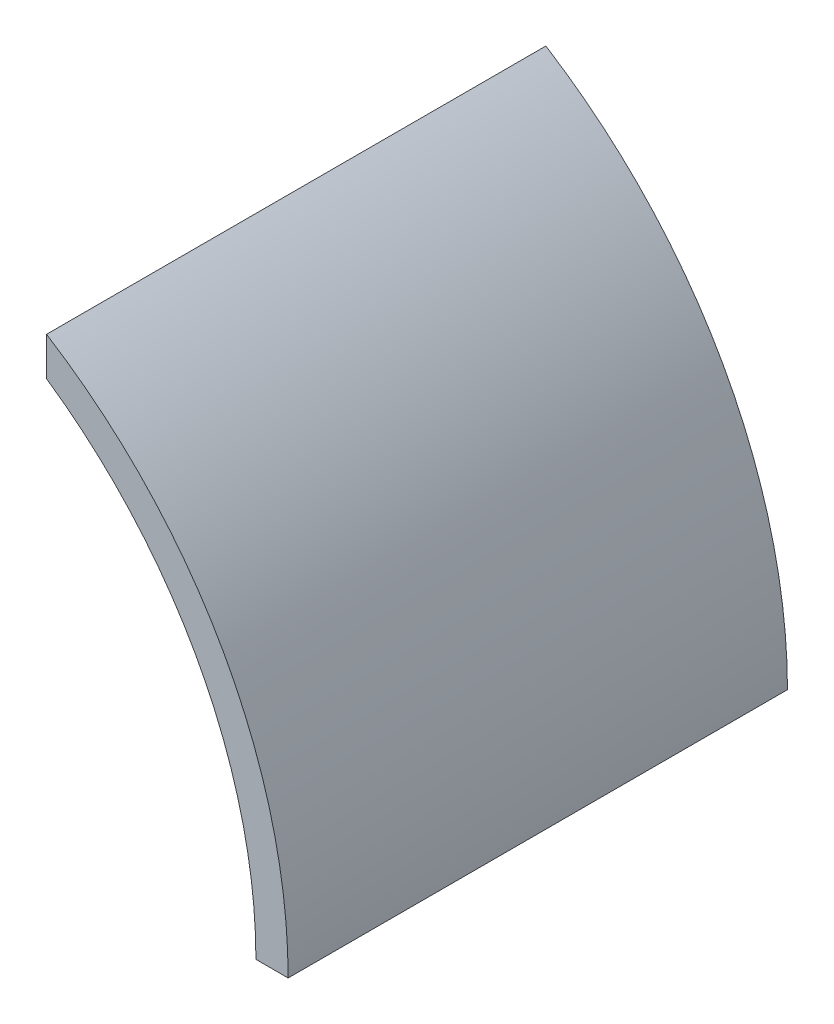
ISO-10303-21;
HEADER;
FILE_DESCRIPTION(('STEP AP214'),'2;1');
FILE_NAME('part.step','',(''),(''),'','','');
FILE_SCHEMA(('AUTOMOTIVE_DESIGN { 1 0 10303 214 1 1 1 1 }'));
ENDSEC;
DATA;
#1=APPLICATION_CONTEXT('core data for automotive mechanical design processes');
#2=APPLICATION_PROTOCOL_DEFINITION('international standard','automotive_design',2000,#1);
#3=PRODUCT_CONTEXT('',#1,'mechanical');
#4=PRODUCT('Part','Part','',(#3));
#5=PRODUCT_RELATED_PRODUCT_CATEGORY('part','',(#4));
#6=PRODUCT_DEFINITION_FORMATION('','',#4);
#7=PRODUCT_DEFINITION_CONTEXT('part definition',#1,'design');
#8=PRODUCT_DEFINITION('design','',#6,#7);
#9=PRODUCT_DEFINITION_SHAPE('','',#8);
#10=(LENGTH_UNIT() NAMED_UNIT(*) SI_UNIT(.MILLI.,.METRE.));
#11=(NAMED_UNIT(*) PLANE_ANGLE_UNIT() SI_UNIT($,.RADIAN.));
#12=(NAMED_UNIT(*) SI_UNIT($,.STERADIAN.) SOLID_ANGLE_UNIT());
#13=UNCERTAINTY_MEASURE_WITH_UNIT(LENGTH_MEASURE(1.E-05),#10,'distance_accuracy_value','');
#14=(GEOMETRIC_REPRESENTATION_CONTEXT(3) GLOBAL_UNCERTAINTY_ASSIGNED_CONTEXT((#13)) GLOBAL_UNIT_ASSIGNED_CONTEXT((#10,
#11,#12)) REPRESENTATION_CONTEXT('',''));
#15=CARTESIAN_POINT('',(0.,0.,0.));
#16=DIRECTION('',(0.,0.,1.));
#17=DIRECTION('',(1.,0.,0.));
#18=AXIS2_PLACEMENT_3D('',#15,#16,#17);
#19=CARTESIAN_POINT('',(0.,0.,155.));
#20=DIRECTION('',(0.,0.,-1.));
#21=DIRECTION('',(-1.,0.,0.));
#22=AXIS2_PLACEMENT_3D('',#19,#20,#21);
#23=CYLINDRICAL_SURFACE('',#22,150.);
#24=CARTESIAN_POINT('',(0.,0.,0.));
#25=DIRECTION('',(0.,0.,-1.));
#26=DIRECTION('',(-1.,0.,0.));
#27=AXIS2_PLACEMENT_3D('',#24,#25,#26);
#28=CIRCLE('',#27,150.);
#29=CARTESIAN_POINT('',(85.,123.592070943083,0.));
#30=VERTEX_POINT('',#29);
#31=CARTESIAN_POINT('',(150.,0.,0.));
#32=VERTEX_POINT('',#31);
#33=EDGE_CURVE('E97',#30,#32,#28,.T.);
#34=ORIENTED_EDGE('',*,*,#33,.T.);
#35=DIRECTION('',(0.,0.,-1.));
#36=VECTOR('',#35,1.);
#37=CARTESIAN_POINT('',(150.,0.,155.));
#38=LINE('',#37,#36);
#39=CARTESIAN_POINT('',(150.,0.,155.));
#40=VERTEX_POINT('',#39);
#41=EDGE_CURVE('E11',#40,#32,#38,.T.);
#42=ORIENTED_EDGE('',*,*,#41,.F.);
#43=CARTESIAN_POINT('',(0.,0.,155.));
#44=DIRECTION('',(0.,0.,-1.));
#45=DIRECTION('',(-1.,0.,0.));
#46=AXIS2_PLACEMENT_3D('',#43,#44,#45);
#47=CIRCLE('',#46,150.);
#48=CARTESIAN_POINT('',(85.,123.592070943083,155.));
#49=VERTEX_POINT('',#48);
#50=EDGE_CURVE('E85',#49,#40,#47,.T.);
#51=ORIENTED_EDGE('',*,*,#50,.F.);
#52=DIRECTION('',(0.,0.,-1.));
#53=VECTOR('',#52,1.);
#54=CARTESIAN_POINT('',(85.,123.592070943083,155.));
#55=LINE('',#54,#53);
#56=EDGE_CURVE('E93',#49,#30,#55,.T.);
#57=ORIENTED_EDGE('',*,*,#56,.T.);
#58=EDGE_LOOP('',(#34,#42,#51,#57));
#59=FACE_BOUND('',#58,.T.);
#60=ADVANCED_FACE('F34',(#59),#23,.F.);
#61=CARTESIAN_POINT('',(150.,0.,155.));
#62=DIRECTION('',(0.,1.,0.));
#63=DIRECTION('',(-1.,0.,0.));
#64=AXIS2_PLACEMENT_3D('',#61,#62,#63);
#65=PLANE('',#64);
#66=DIRECTION('',(1.,0.,0.));
#67=VECTOR('',#66,1.);
#68=CARTESIAN_POINT('',(150.,0.,0.));
#69=LINE('',#68,#67);
#70=CARTESIAN_POINT('',(160.,0.,0.));
#71=VERTEX_POINT('',#70);
#72=EDGE_CURVE('E89',#32,#71,#69,.T.);
#73=ORIENTED_EDGE('',*,*,#72,.T.);
#74=DIRECTION('',(0.,0.,-1.));
#75=VECTOR('',#74,1.);
#76=CARTESIAN_POINT('',(160.,0.,155.));
#77=LINE('',#76,#75);
#78=CARTESIAN_POINT('',(160.,0.,155.));
#79=VERTEX_POINT('',#78);
#80=EDGE_CURVE('E42',#79,#71,#77,.T.);
#81=ORIENTED_EDGE('',*,*,#80,.F.);
#82=DIRECTION('',(1.,0.,0.));
#83=VECTOR('',#82,1.);
#84=CARTESIAN_POINT('',(150.,0.,155.));
#85=LINE('',#84,#83);
#86=EDGE_CURVE('E80',#40,#79,#85,.T.);
#87=ORIENTED_EDGE('',*,*,#86,.F.);
#88=ORIENTED_EDGE('',*,*,#41,.T.);
#89=EDGE_LOOP('',(#73,#81,#87,#88));
#90=FACE_BOUND('',#89,.T.);
#91=ADVANCED_FACE('F88',(#90),#65,.F.);
#92=CARTESIAN_POINT('',(0.,0.,155.));
#93=DIRECTION('',(0.,0.,-1.));
#94=DIRECTION('',(-1.,0.,0.));
#95=AXIS2_PLACEMENT_3D('',#92,#93,#94);
#96=CYLINDRICAL_SURFACE('',#95,160.);
#97=CARTESIAN_POINT('',(0.,0.,0.));
#98=DIRECTION('',(0.,0.,1.));
#99=DIRECTION('',(1.,0.,0.));
#100=AXIS2_PLACEMENT_3D('',#97,#98,#99);
#101=CIRCLE('',#100,160.);
#102=CARTESIAN_POINT('',(85.,135.55441711726,0.));
#103=VERTEX_POINT('',#102);
#104=EDGE_CURVE('E67',#71,#103,#101,.T.);
#105=ORIENTED_EDGE('',*,*,#104,.T.);
#106=DIRECTION('',(0.,0.,-1.));
#107=VECTOR('',#106,1.);
#108=CARTESIAN_POINT('',(85.,135.55441711726,155.));
#109=LINE('',#108,#107);
#110=CARTESIAN_POINT('',(85.,135.55441711726,155.));
#111=VERTEX_POINT('',#110);
#112=EDGE_CURVE('E90',#111,#103,#109,.T.);
#113=ORIENTED_EDGE('',*,*,#112,.F.);
#114=CARTESIAN_POINT('',(0.,0.,155.));
#115=DIRECTION('',(0.,0.,1.));
#116=DIRECTION('',(1.,0.,0.));
#117=AXIS2_PLACEMENT_3D('',#114,#115,#116);
#118=CIRCLE('',#117,160.);
#119=EDGE_CURVE('E83',#79,#111,#118,.T.);
#120=ORIENTED_EDGE('',*,*,#119,.F.);
#121=ORIENTED_EDGE('',*,*,#80,.T.);
#122=EDGE_LOOP('',(#105,#113,#120,#121));
#123=FACE_BOUND('',#122,.T.);
#124=ADVANCED_FACE('F91',(#123),#96,.T.);
#125=CARTESIAN_POINT('',(85.,135.55441711726,155.));
#126=DIRECTION('',(1.,0.,0.));
#127=DIRECTION('',(0.,0.,-1.));
#128=AXIS2_PLACEMENT_3D('',#125,#126,#127);
#129=PLANE('',#128);
#130=DIRECTION('',(0.,-1.,0.));
#131=VECTOR('',#130,1.);
#132=CARTESIAN_POINT('',(85.,135.55441711726,0.));
#133=LINE('',#132,#131);
#134=EDGE_CURVE('E73',#103,#30,#133,.T.);
#135=ORIENTED_EDGE('',*,*,#134,.T.);
#136=ORIENTED_EDGE('',*,*,#56,.F.);
#137=DIRECTION('',(0.,-1.,0.));
#138=VECTOR('',#137,1.);
#139=CARTESIAN_POINT('',(85.,135.55441711726,155.));
#140=LINE('',#139,#138);
#141=EDGE_CURVE('E50',#111,#49,#140,.T.);
#142=ORIENTED_EDGE('',*,*,#141,.F.);
#143=ORIENTED_EDGE('',*,*,#112,.T.);
#144=EDGE_LOOP('',(#135,#136,#142,#143));
#145=FACE_BOUND('',#144,.T.);
#146=ADVANCED_FACE('F104',(#145),#129,.F.);
#147=CARTESIAN_POINT('',(0.,0.,155.));
#148=DIRECTION('',(0.,0.,-1.));
#149=DIRECTION('',(-1.,0.,0.));
#150=AXIS2_PLACEMENT_3D('',#147,#148,#149);
#151=PLANE('',#150);
#152=ORIENTED_EDGE('',*,*,#50,.T.);
#153=ORIENTED_EDGE('',*,*,#86,.T.);
#154=ORIENTED_EDGE('',*,*,#119,.T.);
#155=ORIENTED_EDGE('',*,*,#141,.T.);
#156=EDGE_LOOP('',(#152,#153,#154,#155));
#157=FACE_BOUND('',#156,.T.);
#158=ADVANCED_FACE('F81',(#157),#151,.F.);
#159=CARTESIAN_POINT('',(0.,0.,0.));
#160=DIRECTION('',(0.,0.,-1.));
#161=DIRECTION('',(-1.,0.,0.));
#162=AXIS2_PLACEMENT_3D('',#159,#160,#161);
#163=PLANE('',#162);
#164=ORIENTED_EDGE('',*,*,#33,.F.);
#165=ORIENTED_EDGE('',*,*,#134,.F.);
#166=ORIENTED_EDGE('',*,*,#104,.F.);
#167=ORIENTED_EDGE('',*,*,#72,.F.);
#168=EDGE_LOOP('',(#164,#165,#166,#167));
#169=FACE_BOUND('',#168,.T.);
#170=ADVANCED_FACE('F107',(#169),#163,.T.);
#171=CLOSED_SHELL('',(#60,#91,#124,#146,#158,#170));
#172=MANIFOLD_SOLID_BREP('B2',#171);
#173=ADVANCED_BREP_SHAPE_REPRESENTATION('',(#18,#172),#14);
#174=SHAPE_DEFINITION_REPRESENTATION(#9,#173);
ENDSEC;
END-ISO-10303-21;
